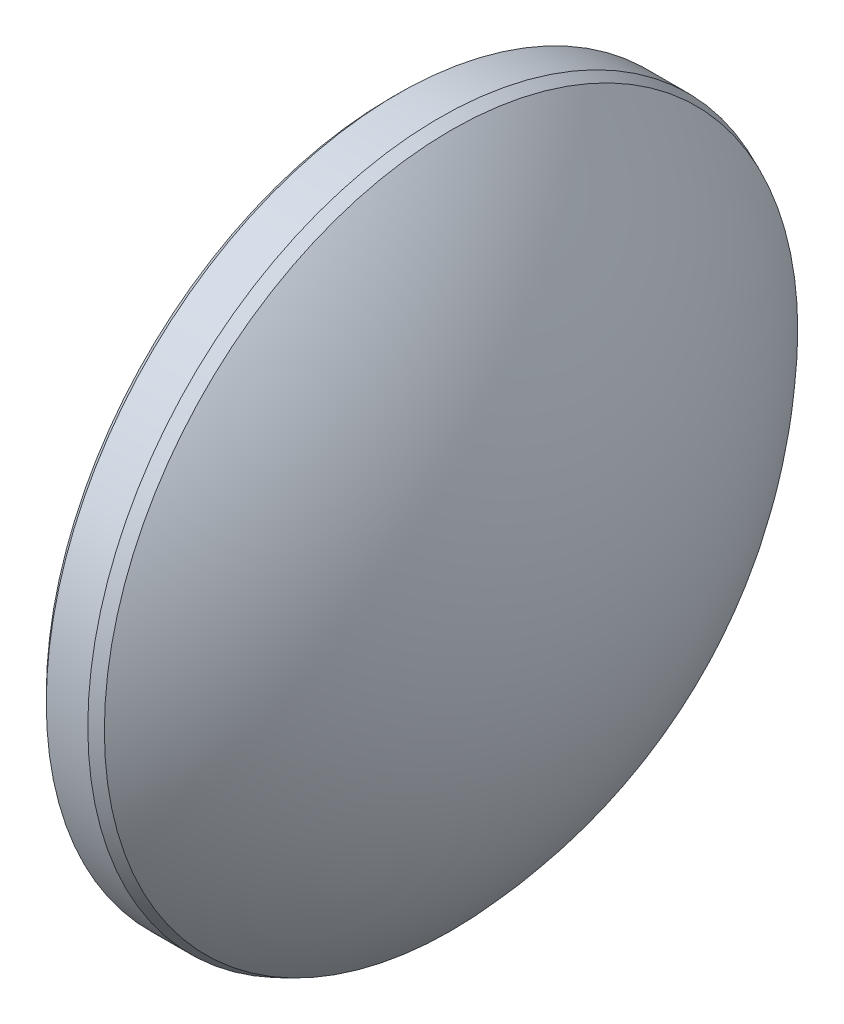
ISO-10303-21;
HEADER;
FILE_DESCRIPTION(('STEP AP214'),'2;1');
FILE_NAME('part.step','',(''),(''),'','','');
FILE_SCHEMA(('AUTOMOTIVE_DESIGN { 1 0 10303 214 1 1 1 1 }'));
ENDSEC;
DATA;
#1=APPLICATION_CONTEXT('core data for automotive mechanical design processes');
#2=APPLICATION_PROTOCOL_DEFINITION('international standard','automotive_design',2000,#1);
#3=PRODUCT_CONTEXT('',#1,'mechanical');
#4=PRODUCT('Part','Part','',(#3));
#5=PRODUCT_RELATED_PRODUCT_CATEGORY('part','',(#4));
#6=PRODUCT_DEFINITION_FORMATION('','',#4);
#7=PRODUCT_DEFINITION_CONTEXT('part definition',#1,'design');
#8=PRODUCT_DEFINITION('design','',#6,#7);
#9=PRODUCT_DEFINITION_SHAPE('','',#8);
#10=(LENGTH_UNIT() NAMED_UNIT(*) SI_UNIT(.MILLI.,.METRE.));
#11=(NAMED_UNIT(*) PLANE_ANGLE_UNIT() SI_UNIT($,.RADIAN.));
#12=(NAMED_UNIT(*) SI_UNIT($,.STERADIAN.) SOLID_ANGLE_UNIT());
#13=UNCERTAINTY_MEASURE_WITH_UNIT(LENGTH_MEASURE(1.E-05),#10,'distance_accuracy_value','');
#14=(GEOMETRIC_REPRESENTATION_CONTEXT(3) GLOBAL_UNCERTAINTY_ASSIGNED_CONTEXT((#13)) GLOBAL_UNIT_ASSIGNED_CONTEXT((#10,
#11,#12)) REPRESENTATION_CONTEXT('',''));
#15=CARTESIAN_POINT('',(0.,0.,0.));
#16=DIRECTION('',(0.,0.,1.));
#17=DIRECTION('',(1.,0.,0.));
#18=AXIS2_PLACEMENT_3D('',#15,#16,#17);
#19=CARTESIAN_POINT('',(-3.55,0.,0.));
#20=DIRECTION('',(1.,0.,0.));
#21=DIRECTION('',(0.,0.,-1.));
#22=AXIS2_PLACEMENT_3D('',#19,#20,#21);
#23=PLANE('',#22);
#24=CARTESIAN_POINT('',(-3.55,0.,0.));
#25=DIRECTION('',(1.,0.,0.));
#26=DIRECTION('',(0.,0.,-1.));
#27=AXIS2_PLACEMENT_3D('',#24,#25,#26);
#28=CIRCLE('',#27,12.45);
#29=CARTESIAN_POINT('',(-3.55,0.,-12.45));
#30=VERTEX_POINT('',#29);
#31=EDGE_CURVE('E10',#30,#30,#28,.F.);
#32=ORIENTED_EDGE('',*,*,#31,.T.);
#33=EDGE_LOOP('',(#32));
#34=FACE_BOUND('',#33,.T.);
#35=ADVANCED_FACE('F15',(#34),#23,.F.);
#36=CARTESIAN_POINT('',(-3.55,0.,0.));
#37=DIRECTION('',(-1.,0.,0.));
#38=DIRECTION('',(0.,0.,1.));
#39=AXIS2_PLACEMENT_3D('',#36,#37,#38);
#40=CYLINDRICAL_SURFACE('',#39,12.7);
#41=CARTESIAN_POINT('',(-1.79999999999998,0.,0.));
#42=DIRECTION('',(-1.,0.,0.));
#43=DIRECTION('',(0.,0.,1.));
#44=AXIS2_PLACEMENT_3D('',#41,#42,#43);
#45=CIRCLE('',#44,12.7);
#46=CARTESIAN_POINT('',(-1.79999999999998,0.,12.7));
#47=VERTEX_POINT('',#46);
#48=EDGE_CURVE('E55',#47,#47,#45,.T.);
#49=ORIENTED_EDGE('',*,*,#48,.T.);
#50=EDGE_LOOP('',(#49));
#51=FACE_BOUND('',#50,.T.);
#52=CARTESIAN_POINT('',(-3.3,0.,0.));
#53=DIRECTION('',(1.,0.,0.));
#54=DIRECTION('',(0.,0.,-1.));
#55=AXIS2_PLACEMENT_3D('',#52,#53,#54);
#56=CIRCLE('',#55,12.7);
#57=CARTESIAN_POINT('',(-3.3,0.,-12.7));
#58=VERTEX_POINT('',#57);
#59=EDGE_CURVE('E53',#58,#58,#56,.T.);
#60=ORIENTED_EDGE('',*,*,#59,.T.);
#61=EDGE_LOOP('',(#60));
#62=FACE_BOUND('',#61,.T.);
#63=ADVANCED_FACE('F28',(#51,#62),#40,.T.);
#64=CARTESIAN_POINT('',(-14.8499939199067,0.,-0.0149581883089785));
#65=DIRECTION('',(0.,-1.,0.));
#66=DIRECTION('',(0.,0.,1.));
#67=AXIS2_PLACEMENT_3D('',#64,#65,#66);
#68=CIRCLE('',#67,18.4);
#69=TRIMMED_CURVE('',#68,(PARAMETER_VALUE(-1.56998338168856)),
(PARAMETER_VALUE(1.56998338168856)),.T.,.PARAMETER.);
#70=CARTESIAN_POINT('',(-14.8499939199067,0.,0.));
#71=DIRECTION('',(-1.,0.,0.));
#72=AXIS1_PLACEMENT('',#70,#71);
#73=SURFACE_OF_REVOLUTION('',#69,#72);
#74=CARTESIAN_POINT('',(-1.38109437925348,0.,0.));
#75=DIRECTION('',(-1.,0.,0.));
#76=DIRECTION('',(0.,0.,1.));
#77=AXIS2_PLACEMENT_3D('',#74,#75,#76);
#78=CIRCLE('',#77,12.5209400708423);
#79=CARTESIAN_POINT('',(-1.38109437925348,0.,12.5209400708423));
#80=VERTEX_POINT('',#79);
#81=EDGE_CURVE('E22',#80,#80,#78,.F.);
#82=ORIENTED_EDGE('',*,*,#81,.T.);
#83=EDGE_LOOP('',(#82));
#84=FACE_BOUND('',#83,.T.);
#85=CARTESIAN_POINT('',(3.55,0.,0.));
#86=VERTEX_POINT('',#85);
#87=VERTEX_LOOP('',#86);
#88=FACE_BOUND('',#87,.T.);
#89=ADVANCED_FACE('F25',(#84,#88),#73,.T.);
#90=CARTESIAN_POINT('',(-1.79999999999998,0.,0.));
#91=DIRECTION('',(-1.,0.,0.));
#92=DIRECTION('',(0.,0.,1.));
#93=AXIS2_PLACEMENT_3D('',#90,#91,#92);
#94=CONICAL_SURFACE('',#93,12.7,0.403941407567805);
#95=ORIENTED_EDGE('',*,*,#81,.F.);
#96=EDGE_LOOP('',(#95));
#97=FACE_BOUND('',#96,.T.);
#98=ORIENTED_EDGE('',*,*,#48,.F.);
#99=EDGE_LOOP('',(#98));
#100=FACE_BOUND('',#99,.T.);
#101=ADVANCED_FACE('F27',(#97,#100),#94,.T.);
#102=CARTESIAN_POINT('',(-3.55,0.,0.));
#103=DIRECTION('',(1.,0.,0.));
#104=DIRECTION('',(0.,0.,-1.));
#105=AXIS2_PLACEMENT_3D('',#102,#103,#104);
#106=CONICAL_SURFACE('',#105,12.45,0.785398163397455);
#107=ORIENTED_EDGE('',*,*,#59,.F.);
#108=EDGE_LOOP('',(#107));
#109=FACE_BOUND('',#108,.T.);
#110=ORIENTED_EDGE('',*,*,#31,.F.);
#111=EDGE_LOOP('',(#110));
#112=FACE_BOUND('',#111,.T.);
#113=ADVANCED_FACE('F17',(#109,#112),#106,.T.);
#114=CLOSED_SHELL('',(#35,#63,#89,#101,#113));
#115=MANIFOLD_SOLID_BREP('B1',#114);
#116=ADVANCED_BREP_SHAPE_REPRESENTATION('',(#18,#115),#14);
#117=SHAPE_DEFINITION_REPRESENTATION(#9,#116);
ENDSEC;
END-ISO-10303-21;
